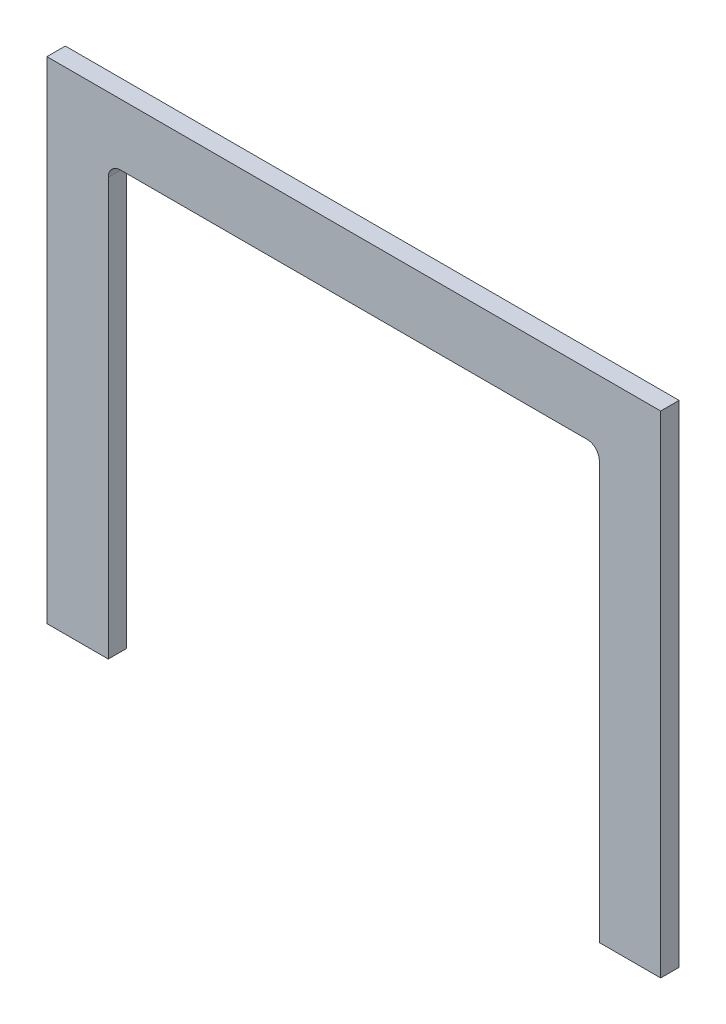
ISO-10303-21;
HEADER;
FILE_DESCRIPTION(('STEP AP214'),'2;1');
FILE_NAME('part.step','',(''),(''),'','','');
FILE_SCHEMA(('AUTOMOTIVE_DESIGN { 1 0 10303 214 1 1 1 1 }'));
ENDSEC;
DATA;
#1=APPLICATION_CONTEXT('core data for automotive mechanical design processes');
#2=APPLICATION_PROTOCOL_DEFINITION('international standard','automotive_design',2000,#1);
#3=PRODUCT_CONTEXT('',#1,'mechanical');
#4=PRODUCT('Part','Part','',(#3));
#5=PRODUCT_RELATED_PRODUCT_CATEGORY('part','',(#4));
#6=PRODUCT_DEFINITION_FORMATION('','',#4);
#7=PRODUCT_DEFINITION_CONTEXT('part definition',#1,'design');
#8=PRODUCT_DEFINITION('design','',#6,#7);
#9=PRODUCT_DEFINITION_SHAPE('','',#8);
#10=(LENGTH_UNIT() NAMED_UNIT(*) SI_UNIT(.MILLI.,.METRE.));
#11=(NAMED_UNIT(*) PLANE_ANGLE_UNIT() SI_UNIT($,.RADIAN.));
#12=(NAMED_UNIT(*) SI_UNIT($,.STERADIAN.) SOLID_ANGLE_UNIT());
#13=UNCERTAINTY_MEASURE_WITH_UNIT(LENGTH_MEASURE(1.E-05),#10,'distance_accuracy_value','');
#14=(GEOMETRIC_REPRESENTATION_CONTEXT(3) GLOBAL_UNCERTAINTY_ASSIGNED_CONTEXT((#13)) GLOBAL_UNIT_ASSIGNED_CONTEXT((#10,
#11,#12)) REPRESENTATION_CONTEXT('',''));
#15=CARTESIAN_POINT('',(0.,0.,0.));
#16=DIRECTION('',(0.,0.,1.));
#17=DIRECTION('',(1.,0.,0.));
#18=AXIS2_PLACEMENT_3D('',#15,#16,#17);
#19=CARTESIAN_POINT('',(250.,-200.,15.));
#20=DIRECTION('',(-1.,0.,0.));
#21=DIRECTION('',(0.,-1.,0.));
#22=AXIS2_PLACEMENT_3D('',#19,#20,#21);
#23=PLANE('',#22);
#24=DIRECTION('',(0.,1.,0.));
#25=VECTOR('',#24,1.);
#26=CARTESIAN_POINT('',(250.,-200.,0.));
#27=LINE('',#26,#25);
#28=CARTESIAN_POINT('',(250.,-200.,0.));
#29=VERTEX_POINT('',#28);
#30=CARTESIAN_POINT('',(250.,200.,0.));
#31=VERTEX_POINT('',#30);
#32=EDGE_CURVE('E143',#29,#31,#27,.T.);
#33=ORIENTED_EDGE('',*,*,#32,.T.);
#34=DIRECTION('',(0.,0.,-1.));
#35=VECTOR('',#34,1.);
#36=CARTESIAN_POINT('',(250.,200.,15.));
#37=LINE('',#36,#35);
#38=CARTESIAN_POINT('',(250.,200.,15.));
#39=VERTEX_POINT('',#38);
#40=EDGE_CURVE('E11',#39,#31,#37,.T.);
#41=ORIENTED_EDGE('',*,*,#40,.F.);
#42=DIRECTION('',(0.,1.,0.));
#43=VECTOR('',#42,1.);
#44=CARTESIAN_POINT('',(250.,-200.,15.));
#45=LINE('',#44,#43);
#46=CARTESIAN_POINT('',(250.,-200.,15.));
#47=VERTEX_POINT('',#46);
#48=EDGE_CURVE('E161',#47,#39,#45,.T.);
#49=ORIENTED_EDGE('',*,*,#48,.F.);
#50=DIRECTION('',(0.,0.,-1.));
#51=VECTOR('',#50,1.);
#52=CARTESIAN_POINT('',(250.,-200.,15.));
#53=LINE('',#52,#51);
#54=EDGE_CURVE('E139',#47,#29,#53,.T.);
#55=ORIENTED_EDGE('',*,*,#54,.T.);
#56=EDGE_LOOP('',(#33,#41,#49,#55));
#57=FACE_BOUND('',#56,.T.);
#58=ADVANCED_FACE('F35',(#57),#23,.F.);
#59=CARTESIAN_POINT('',(-250.,200.,15.));
#60=DIRECTION('',(0.,-1.,0.));
#61=DIRECTION('',(0.,0.,-1.));
#62=AXIS2_PLACEMENT_3D('',#59,#60,#61);
#63=PLANE('',#62);
#64=DIRECTION('',(-1.,0.,0.));
#65=VECTOR('',#64,1.);
#66=CARTESIAN_POINT('',(-250.,200.,0.));
#67=LINE('',#66,#65);
#68=CARTESIAN_POINT('',(-250.,200.,0.));
#69=VERTEX_POINT('',#68);
#70=EDGE_CURVE('E146',#31,#69,#67,.T.);
#71=ORIENTED_EDGE('',*,*,#70,.T.);
#72=DIRECTION('',(0.,0.,-1.));
#73=VECTOR('',#72,1.);
#74=CARTESIAN_POINT('',(-250.,200.,15.));
#75=LINE('',#74,#73);
#76=CARTESIAN_POINT('',(-250.,200.,15.));
#77=VERTEX_POINT('',#76);
#78=EDGE_CURVE('E43',#77,#69,#75,.T.);
#79=ORIENTED_EDGE('',*,*,#78,.F.);
#80=DIRECTION('',(-1.,0.,0.));
#81=VECTOR('',#80,1.);
#82=CARTESIAN_POINT('',(-250.,200.,15.));
#83=LINE('',#82,#81);
#84=EDGE_CURVE('E100',#39,#77,#83,.T.);
#85=ORIENTED_EDGE('',*,*,#84,.F.);
#86=ORIENTED_EDGE('',*,*,#40,.T.);
#87=EDGE_LOOP('',(#71,#79,#85,#86));
#88=FACE_BOUND('',#87,.T.);
#89=ADVANCED_FACE('F210',(#88),#63,.F.);
#90=CARTESIAN_POINT('',(-250.,-200.,15.));
#91=DIRECTION('',(1.,0.,0.));
#92=DIRECTION('',(0.,0.,-1.));
#93=AXIS2_PLACEMENT_3D('',#90,#91,#92);
#94=PLANE('',#93);
#95=DIRECTION('',(0.,-1.,0.));
#96=VECTOR('',#95,1.);
#97=CARTESIAN_POINT('',(-250.,-200.,0.));
#98=LINE('',#97,#96);
#99=CARTESIAN_POINT('',(-250.,-200.,0.));
#100=VERTEX_POINT('',#99);
#101=EDGE_CURVE('E148',#69,#100,#98,.T.);
#102=ORIENTED_EDGE('',*,*,#101,.T.);
#103=DIRECTION('',(0.,0.,-1.));
#104=VECTOR('',#103,1.);
#105=CARTESIAN_POINT('',(-250.,-200.,15.));
#106=LINE('',#105,#104);
#107=CARTESIAN_POINT('',(-250.,-200.,15.));
#108=VERTEX_POINT('',#107);
#109=EDGE_CURVE('E174',#108,#100,#106,.T.);
#110=ORIENTED_EDGE('',*,*,#109,.F.);
#111=DIRECTION('',(0.,-1.,0.));
#112=VECTOR('',#111,1.);
#113=CARTESIAN_POINT('',(-250.,-200.,15.));
#114=LINE('',#113,#112);
#115=EDGE_CURVE('E182',#77,#108,#114,.T.);
#116=ORIENTED_EDGE('',*,*,#115,.F.);
#117=ORIENTED_EDGE('',*,*,#78,.T.);
#118=EDGE_LOOP('',(#102,#110,#116,#117));
#119=FACE_BOUND('',#118,.T.);
#120=ADVANCED_FACE('F180',(#119),#94,.F.);
#121=CARTESIAN_POINT('',(-250.,-200.,15.));
#122=DIRECTION('',(0.,1.,0.));
#123=DIRECTION('',(0.,0.,1.));
#124=AXIS2_PLACEMENT_3D('',#121,#122,#123);
#125=PLANE('',#124);
#126=DIRECTION('',(1.,0.,0.));
#127=VECTOR('',#126,1.);
#128=CARTESIAN_POINT('',(-250.,-200.,0.));
#129=LINE('',#128,#127);
#130=CARTESIAN_POINT('',(-200.,-200.,0.));
#131=VERTEX_POINT('',#130);
#132=EDGE_CURVE('E150',#100,#131,#129,.T.);
#133=ORIENTED_EDGE('',*,*,#132,.T.);
#134=DIRECTION('',(0.,0.,-1.));
#135=VECTOR('',#134,1.);
#136=CARTESIAN_POINT('',(-200.,-200.,15.));
#137=LINE('',#136,#135);
#138=CARTESIAN_POINT('',(-200.,-200.,15.));
#139=VERTEX_POINT('',#138);
#140=EDGE_CURVE('E171',#139,#131,#137,.T.);
#141=ORIENTED_EDGE('',*,*,#140,.F.);
#142=DIRECTION('',(1.,0.,0.));
#143=VECTOR('',#142,1.);
#144=CARTESIAN_POINT('',(-250.,-200.,15.));
#145=LINE('',#144,#143);
#146=EDGE_CURVE('E200',#108,#139,#145,.T.);
#147=ORIENTED_EDGE('',*,*,#146,.F.);
#148=ORIENTED_EDGE('',*,*,#109,.T.);
#149=EDGE_LOOP('',(#133,#141,#147,#148));
#150=FACE_BOUND('',#149,.T.);
#151=ADVANCED_FACE('F191',(#150),#125,.F.);
#152=CARTESIAN_POINT('',(-200.,-200.,15.));
#153=DIRECTION('',(-1.,0.,0.));
#154=DIRECTION('',(0.,-1.,0.));
#155=AXIS2_PLACEMENT_3D('',#152,#153,#154);
#156=PLANE('',#155);
#157=DIRECTION('',(0.,1.,0.));
#158=VECTOR('',#157,1.);
#159=CARTESIAN_POINT('',(-200.,-200.,0.));
#160=LINE('',#159,#158);
#161=CARTESIAN_POINT('',(-200.,140.,0.));
#162=VERTEX_POINT('',#161);
#163=EDGE_CURVE('E152',#131,#162,#160,.T.);
#164=ORIENTED_EDGE('',*,*,#163,.T.);
#165=DIRECTION('',(0.,0.,-1.));
#166=VECTOR('',#165,1.);
#167=CARTESIAN_POINT('',(-200.,140.,15.));
#168=LINE('',#167,#166);
#169=CARTESIAN_POINT('',(-200.,140.,15.));
#170=VERTEX_POINT('',#169);
#171=EDGE_CURVE('E168',#170,#162,#168,.T.);
#172=ORIENTED_EDGE('',*,*,#171,.F.);
#173=DIRECTION('',(0.,1.,0.));
#174=VECTOR('',#173,1.);
#175=CARTESIAN_POINT('',(-200.,-200.,15.));
#176=LINE('',#175,#174);
#177=EDGE_CURVE('E197',#139,#170,#176,.T.);
#178=ORIENTED_EDGE('',*,*,#177,.F.);
#179=ORIENTED_EDGE('',*,*,#140,.T.);
#180=EDGE_LOOP('',(#164,#172,#178,#179));
#181=FACE_BOUND('',#180,.T.);
#182=ADVANCED_FACE('F195',(#181),#156,.F.);
#183=CARTESIAN_POINT('',(-190.,140.,15.));
#184=DIRECTION('',(0.,0.,-1.));
#185=DIRECTION('',(-1.,0.,0.));
#186=AXIS2_PLACEMENT_3D('',#183,#184,#185);
#187=CYLINDRICAL_SURFACE('',#186,10.);
#188=CARTESIAN_POINT('',(-190.,140.,0.));
#189=DIRECTION('',(0.,0.,-1.));
#190=DIRECTION('',(1.,0.,0.));
#191=AXIS2_PLACEMENT_3D('',#188,#189,#190);
#192=CIRCLE('',#191,10.);
#193=CARTESIAN_POINT('',(-190.,150.,0.));
#194=VERTEX_POINT('',#193);
#195=EDGE_CURVE('E154',#162,#194,#192,.T.);
#196=ORIENTED_EDGE('',*,*,#195,.T.);
#197=DIRECTION('',(0.,0.,-1.));
#198=VECTOR('',#197,1.);
#199=CARTESIAN_POINT('',(-190.,150.,15.));
#200=LINE('',#199,#198);
#201=CARTESIAN_POINT('',(-190.,150.,15.));
#202=VERTEX_POINT('',#201);
#203=EDGE_CURVE('E165',#202,#194,#200,.T.);
#204=ORIENTED_EDGE('',*,*,#203,.F.);
#205=CARTESIAN_POINT('',(-190.,140.,15.));
#206=DIRECTION('',(0.,0.,-1.));
#207=DIRECTION('',(1.,0.,0.));
#208=AXIS2_PLACEMENT_3D('',#205,#206,#207);
#209=CIRCLE('',#208,10.);
#210=EDGE_CURVE('E199',#170,#202,#209,.T.);
#211=ORIENTED_EDGE('',*,*,#210,.F.);
#212=ORIENTED_EDGE('',*,*,#171,.T.);
#213=EDGE_LOOP('',(#196,#204,#211,#212));
#214=FACE_BOUND('',#213,.T.);
#215=ADVANCED_FACE('F222',(#214),#187,.F.);
#216=CARTESIAN_POINT('',(-190.,150.,15.));
#217=DIRECTION('',(0.,1.,0.));
#218=DIRECTION('',(0.,0.,1.));
#219=AXIS2_PLACEMENT_3D('',#216,#217,#218);
#220=PLANE('',#219);
#221=DIRECTION('',(1.,0.,0.));
#222=VECTOR('',#221,1.);
#223=CARTESIAN_POINT('',(-190.,150.,0.));
#224=LINE('',#223,#222);
#225=CARTESIAN_POINT('',(190.,150.,0.));
#226=VERTEX_POINT('',#225);
#227=EDGE_CURVE('E156',#194,#226,#224,.T.);
#228=ORIENTED_EDGE('',*,*,#227,.T.);
#229=DIRECTION('',(0.,0.,-1.));
#230=VECTOR('',#229,1.);
#231=CARTESIAN_POINT('',(190.,150.,15.));
#232=LINE('',#231,#230);
#233=CARTESIAN_POINT('',(190.,150.,15.));
#234=VERTEX_POINT('',#233);
#235=EDGE_CURVE('E134',#234,#226,#232,.T.);
#236=ORIENTED_EDGE('',*,*,#235,.F.);
#237=DIRECTION('',(1.,0.,0.));
#238=VECTOR('',#237,1.);
#239=CARTESIAN_POINT('',(-190.,150.,15.));
#240=LINE('',#239,#238);
#241=EDGE_CURVE('E125',#202,#234,#240,.T.);
#242=ORIENTED_EDGE('',*,*,#241,.F.);
#243=ORIENTED_EDGE('',*,*,#203,.T.);
#244=EDGE_LOOP('',(#228,#236,#242,#243));
#245=FACE_BOUND('',#244,.T.);
#246=ADVANCED_FACE('F225',(#245),#220,.F.);
#247=CARTESIAN_POINT('',(190.,140.,15.));
#248=DIRECTION('',(0.,0.,-1.));
#249=DIRECTION('',(-1.,0.,0.));
#250=AXIS2_PLACEMENT_3D('',#247,#248,#249);
#251=CYLINDRICAL_SURFACE('',#250,10.);
#252=CARTESIAN_POINT('',(190.,140.,0.));
#253=DIRECTION('',(0.,0.,-1.));
#254=DIRECTION('',(1.,0.,0.));
#255=AXIS2_PLACEMENT_3D('',#252,#253,#254);
#256=CIRCLE('',#255,10.);
#257=CARTESIAN_POINT('',(200.,140.,0.));
#258=VERTEX_POINT('',#257);
#259=EDGE_CURVE('E133',#226,#258,#256,.T.);
#260=ORIENTED_EDGE('',*,*,#259,.T.);
#261=DIRECTION('',(0.,0.,-1.));
#262=VECTOR('',#261,1.);
#263=CARTESIAN_POINT('',(200.,140.,15.));
#264=LINE('',#263,#262);
#265=CARTESIAN_POINT('',(200.,140.,15.));
#266=VERTEX_POINT('',#265);
#267=EDGE_CURVE('E130',#266,#258,#264,.T.);
#268=ORIENTED_EDGE('',*,*,#267,.F.);
#269=CARTESIAN_POINT('',(190.,140.,15.));
#270=DIRECTION('',(0.,0.,-1.));
#271=DIRECTION('',(1.,0.,0.));
#272=AXIS2_PLACEMENT_3D('',#269,#270,#271);
#273=CIRCLE('',#272,10.);
#274=EDGE_CURVE('E119',#234,#266,#273,.T.);
#275=ORIENTED_EDGE('',*,*,#274,.F.);
#276=ORIENTED_EDGE('',*,*,#235,.T.);
#277=EDGE_LOOP('',(#260,#268,#275,#276));
#278=FACE_BOUND('',#277,.T.);
#279=ADVANCED_FACE('F131',(#278),#251,.F.);
#280=CARTESIAN_POINT('',(200.,140.,15.));
#281=DIRECTION('',(1.,0.,0.));
#282=DIRECTION('',(0.,1.,0.));
#283=AXIS2_PLACEMENT_3D('',#280,#281,#282);
#284=PLANE('',#283);
#285=DIRECTION('',(0.,-1.,0.));
#286=VECTOR('',#285,1.);
#287=CARTESIAN_POINT('',(200.,140.,0.));
#288=LINE('',#287,#286);
#289=CARTESIAN_POINT('',(200.,-200.,0.));
#290=VERTEX_POINT('',#289);
#291=EDGE_CURVE('E86',#258,#290,#288,.T.);
#292=ORIENTED_EDGE('',*,*,#291,.T.);
#293=DIRECTION('',(0.,0.,-1.));
#294=VECTOR('',#293,1.);
#295=CARTESIAN_POINT('',(200.,-200.,15.));
#296=LINE('',#295,#294);
#297=CARTESIAN_POINT('',(200.,-200.,15.));
#298=VERTEX_POINT('',#297);
#299=EDGE_CURVE('E135',#298,#290,#296,.T.);
#300=ORIENTED_EDGE('',*,*,#299,.F.);
#301=DIRECTION('',(0.,-1.,0.));
#302=VECTOR('',#301,1.);
#303=CARTESIAN_POINT('',(200.,140.,15.));
#304=LINE('',#303,#302);
#305=EDGE_CURVE('E123',#266,#298,#304,.T.);
#306=ORIENTED_EDGE('',*,*,#305,.F.);
#307=ORIENTED_EDGE('',*,*,#267,.T.);
#308=EDGE_LOOP('',(#292,#300,#306,#307));
#309=FACE_BOUND('',#308,.T.);
#310=ADVANCED_FACE('F137',(#309),#284,.F.);
#311=CARTESIAN_POINT('',(200.,-200.,15.));
#312=DIRECTION('',(0.,1.,0.));
#313=DIRECTION('',(0.,0.,1.));
#314=AXIS2_PLACEMENT_3D('',#311,#312,#313);
#315=PLANE('',#314);
#316=DIRECTION('',(1.,0.,0.));
#317=VECTOR('',#316,1.);
#318=CARTESIAN_POINT('',(200.,-200.,0.));
#319=LINE('',#318,#317);
#320=EDGE_CURVE('E92',#290,#29,#319,.T.);
#321=ORIENTED_EDGE('',*,*,#320,.T.);
#322=ORIENTED_EDGE('',*,*,#54,.F.);
#323=DIRECTION('',(1.,0.,0.));
#324=VECTOR('',#323,1.);
#325=CARTESIAN_POINT('',(200.,-200.,15.));
#326=LINE('',#325,#324);
#327=EDGE_CURVE('E51',#298,#47,#326,.T.);
#328=ORIENTED_EDGE('',*,*,#327,.F.);
#329=ORIENTED_EDGE('',*,*,#299,.T.);
#330=EDGE_LOOP('',(#321,#322,#328,#329));
#331=FACE_BOUND('',#330,.T.);
#332=ADVANCED_FACE('F234',(#331),#315,.F.);
#333=CARTESIAN_POINT('',(-190.,140.,15.));
#334=DIRECTION('',(0.,0.,1.));
#335=DIRECTION('',(1.,0.,0.));
#336=AXIS2_PLACEMENT_3D('',#333,#334,#335);
#337=PLANE('',#336);
#338=ORIENTED_EDGE('',*,*,#48,.T.);
#339=ORIENTED_EDGE('',*,*,#84,.T.);
#340=ORIENTED_EDGE('',*,*,#115,.T.);
#341=ORIENTED_EDGE('',*,*,#146,.T.);
#342=ORIENTED_EDGE('',*,*,#177,.T.);
#343=ORIENTED_EDGE('',*,*,#210,.T.);
#344=ORIENTED_EDGE('',*,*,#241,.T.);
#345=ORIENTED_EDGE('',*,*,#274,.T.);
#346=ORIENTED_EDGE('',*,*,#305,.T.);
#347=ORIENTED_EDGE('',*,*,#327,.T.);
#348=EDGE_LOOP('',(#338,#339,#340,#341,#342,#343,#344,#345,#346,#347));
#349=FACE_BOUND('',#348,.T.);
#350=ADVANCED_FACE('F121',(#349),#337,.T.);
#351=CARTESIAN_POINT('',(-190.,140.,0.));
#352=DIRECTION('',(0.,0.,1.));
#353=DIRECTION('',(1.,0.,0.));
#354=AXIS2_PLACEMENT_3D('',#351,#352,#353);
#355=PLANE('',#354);
#356=ORIENTED_EDGE('',*,*,#32,.F.);
#357=ORIENTED_EDGE('',*,*,#320,.F.);
#358=ORIENTED_EDGE('',*,*,#291,.F.);
#359=ORIENTED_EDGE('',*,*,#259,.F.);
#360=ORIENTED_EDGE('',*,*,#227,.F.);
#361=ORIENTED_EDGE('',*,*,#195,.F.);
#362=ORIENTED_EDGE('',*,*,#163,.F.);
#363=ORIENTED_EDGE('',*,*,#132,.F.);
#364=ORIENTED_EDGE('',*,*,#101,.F.);
#365=ORIENTED_EDGE('',*,*,#70,.F.);
#366=EDGE_LOOP('',(#356,#357,#358,#359,#360,#361,#362,#363,#364,#365));
#367=FACE_BOUND('',#366,.T.);
#368=ADVANCED_FACE('F186',(#367),#355,.F.);
#369=CLOSED_SHELL('',(#58,#89,#120,#151,#182,#215,#246,#279,#310,#332,#350,#368));
#370=MANIFOLD_SOLID_BREP('B2',#369);
#371=ADVANCED_BREP_SHAPE_REPRESENTATION('',(#18,#370),#14);
#372=SHAPE_DEFINITION_REPRESENTATION(#9,#371);
ENDSEC;
END-ISO-10303-21;
